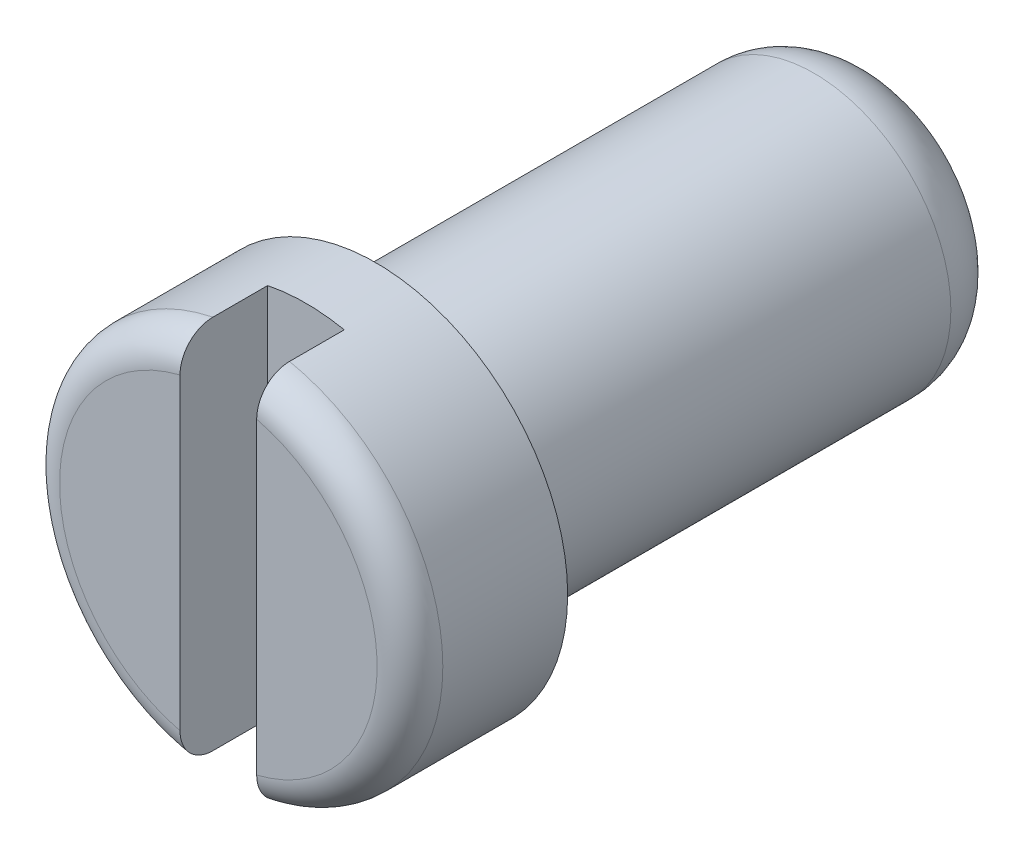
ISO-10303-21;
HEADER;
FILE_DESCRIPTION(('STEP AP214'),'2;1');
FILE_NAME('part.step','',(''),(''),'','','');
FILE_SCHEMA(('AUTOMOTIVE_DESIGN { 1 0 10303 214 1 1 1 1 }'));
ENDSEC;
DATA;
#1=APPLICATION_CONTEXT('core data for automotive mechanical design processes');
#2=APPLICATION_PROTOCOL_DEFINITION('international standard','automotive_design',2000,#1);
#3=PRODUCT_CONTEXT('',#1,'mechanical');
#4=PRODUCT('Part','Part','',(#3));
#5=PRODUCT_RELATED_PRODUCT_CATEGORY('part','',(#4));
#6=PRODUCT_DEFINITION_FORMATION('','',#4);
#7=PRODUCT_DEFINITION_CONTEXT('part definition',#1,'design');
#8=PRODUCT_DEFINITION('design','',#6,#7);
#9=PRODUCT_DEFINITION_SHAPE('','',#8);
#10=(LENGTH_UNIT() NAMED_UNIT(*) SI_UNIT(.MILLI.,.METRE.));
#11=(NAMED_UNIT(*) PLANE_ANGLE_UNIT() SI_UNIT($,.RADIAN.));
#12=(NAMED_UNIT(*) SI_UNIT($,.STERADIAN.) SOLID_ANGLE_UNIT());
#13=UNCERTAINTY_MEASURE_WITH_UNIT(LENGTH_MEASURE(1.E-05),#10,'distance_accuracy_value','');
#14=(GEOMETRIC_REPRESENTATION_CONTEXT(3) GLOBAL_UNCERTAINTY_ASSIGNED_CONTEXT((#13)) GLOBAL_UNIT_ASSIGNED_CONTEXT((#10,
#11,#12)) REPRESENTATION_CONTEXT('',''));
#15=CARTESIAN_POINT('',(0.,0.,0.));
#16=DIRECTION('',(0.,0.,1.));
#17=DIRECTION('',(1.,0.,0.));
#18=AXIS2_PLACEMENT_3D('',#15,#16,#17);
#19=CARTESIAN_POINT('',(0.,0.,0.639999999999999));
#20=DIRECTION('',(0.,0.,1.));
#21=DIRECTION('',(1.,0.,0.));
#22=AXIS2_PLACEMENT_3D('',#19,#20,#21);
#23=PLANE('',#22);
#24=CARTESIAN_POINT('',(0.,0.,0.64));
#25=DIRECTION('',(0.,0.,1.));
#26=DIRECTION('',(1.,0.,0.));
#27=AXIS2_PLACEMENT_3D('',#24,#25,#26);
#28=CIRCLE('',#27,1.75);
#29=CARTESIAN_POINT('',(0.35,1.71464281994822,0.64));
#30=VERTEX_POINT('',#29);
#31=CARTESIAN_POINT('',(-0.35,1.71464281994822,0.64));
#32=VERTEX_POINT('',#31);
#33=EDGE_CURVE('E79',#30,#32,#28,.T.);
#34=ORIENTED_EDGE('',*,*,#33,.T.);
#35=DIRECTION('',(0.,1.,0.));
#36=VECTOR('',#35,1.);
#37=CARTESIAN_POINT('',(-0.35,-2.5,0.64));
#38=LINE('',#37,#36);
#39=CARTESIAN_POINT('',(-0.35,-1.71464281994822,0.64));
#40=VERTEX_POINT('',#39);
#41=EDGE_CURVE('E82',#32,#40,#38,.F.);
#42=ORIENTED_EDGE('',*,*,#41,.T.);
#43=CARTESIAN_POINT('',(0.,0.,0.64));
#44=DIRECTION('',(0.,0.,1.));
#45=DIRECTION('',(1.,0.,0.));
#46=AXIS2_PLACEMENT_3D('',#43,#44,#45);
#47=CIRCLE('',#46,1.75);
#48=CARTESIAN_POINT('',(0.35,-1.71464281994822,0.64));
#49=VERTEX_POINT('',#48);
#50=EDGE_CURVE('E20',#40,#49,#47,.T.);
#51=ORIENTED_EDGE('',*,*,#50,.T.);
#52=DIRECTION('',(0.,1.,0.));
#53=VECTOR('',#52,1.);
#54=CARTESIAN_POINT('',(0.35,2.5,0.64));
#55=LINE('',#54,#53);
#56=EDGE_CURVE('E101',#49,#30,#55,.T.);
#57=ORIENTED_EDGE('',*,*,#56,.T.);
#58=EDGE_LOOP('',(#34,#42,#51,#57));
#59=FACE_BOUND('',#58,.T.);
#60=ADVANCED_FACE('F17',(#59),#23,.T.);
#61=CARTESIAN_POINT('',(0.35,2.5,1.44));
#62=DIRECTION('',(1.,0.,0.));
#63=DIRECTION('',(0.,0.,-1.));
#64=AXIS2_PLACEMENT_3D('',#61,#62,#63);
#65=PLANE('',#64);
#66=DIRECTION('',(0.,1.,0.));
#67=VECTOR('',#66,1.);
#68=CARTESIAN_POINT('',(0.35,0.,1.44));
#69=LINE('',#68,#67);
#70=CARTESIAN_POINT('',(0.35,1.40712472794703,1.44));
#71=VERTEX_POINT('',#70);
#72=CARTESIAN_POINT('',(0.35,-1.40712472794703,1.44));
#73=VERTEX_POINT('',#72);
#74=EDGE_CURVE('E112',#71,#73,#69,.F.);
#75=ORIENTED_EDGE('',*,*,#74,.F.);
#76=CARTESIAN_POINT('',(0.35,1.71464281994822,1.14));
#77=CARTESIAN_POINT('',(0.35,1.71465832877871,1.15661768421238));
#78=CARTESIAN_POINT('',(0.35,1.71323459979991,1.17322940138416));
#79=CARTESIAN_POINT('',(0.35,1.70762507526031,1.20595850036961));
#80=CARTESIAN_POINT('',(0.35,1.70344286069336,1.22207649477159));
#81=CARTESIAN_POINT('',(0.35,1.69243050159149,1.25338609632559));
#82=CARTESIAN_POINT('',(0.35,1.68559952821954,1.26857741178191));
#83=CARTESIAN_POINT('',(0.35,1.66950472990889,1.29760872831782));
#84=CARTESIAN_POINT('',(0.35,1.66024099174605,1.31144877757244));
#85=CARTESIAN_POINT('',(0.35,1.63947569207312,1.33751002731009));
#86=CARTESIAN_POINT('',(0.35,1.62795725429928,1.34971777202392));
#87=CARTESIAN_POINT('',(0.35,1.60306785319839,1.3720715972923));
#88=CARTESIAN_POINT('',(0.35,1.58969659668891,1.38221735093789));
#89=CARTESIAN_POINT('',(0.349999999999999,1.56120821534332,1.40037313395423));
#90=CARTESIAN_POINT('',(0.349999999999997,1.54606213966697,1.40833767773933));
#91=CARTESIAN_POINT('',(0.350000000000003,1.51467022412029,1.42167679982792));
#92=CARTESIAN_POINT('',(0.350000000000011,1.49842455767623,1.4270517854732));
#93=CARTESIAN_POINT('',(0.349999999999992,1.46962834851131,1.43404552472922));
#94=CARTESIAN_POINT('',(0.349999999999974,1.45722301038762,1.43627909035067));
#95=CARTESIAN_POINT('',(0.350000000000026,1.43225435406019,1.43925629166923));
#96=CARTESIAN_POINT('',(0.350000000000095,1.41969131286619,1.44000224901976));
#97=CARTESIAN_POINT('',(0.350000000000261,1.407124727947,1.44));
#98=B_SPLINE_CURVE_WITH_KNOTS('',3,(#76,#77,#78,#79,#80,#81,#82,#83,#84,#85,#86,#87,#88,#89,#90,
#91,#92,#93,#94,#95,#96,#97),.UNSPECIFIED.,.F.,.F.,(4,2,2,2,2,2,2,2,2,2,4),(0.,
0.0497832984911324,0.0995020964712911,0.149236464793092,0.198969059348318,0.249089208160175,
0.299217296854574,0.350322507802393,0.401419677189173,0.439148934538458,0.476819263051026),.UNSPECIFIED.);
#99=CARTESIAN_POINT('',(0.35,1.71464281994822,1.14));
#100=VERTEX_POINT('',#99);
#101=EDGE_CURVE('E100',#100,#71,#98,.T.);
#102=ORIENTED_EDGE('',*,*,#101,.F.);
#103=DIRECTION('',(0.,0.,-1.));
#104=VECTOR('',#103,1.);
#105=CARTESIAN_POINT('',(0.35,1.71464281994823,1.44));
#106=LINE('',#105,#104);
#107=EDGE_CURVE('E98',#30,#100,#106,.F.);
#108=ORIENTED_EDGE('',*,*,#107,.F.);
#109=ORIENTED_EDGE('',*,*,#56,.F.);
#110=DIRECTION('',(0.,0.,-1.));
#111=VECTOR('',#110,1.);
#112=CARTESIAN_POINT('',(0.35,-1.71464281994822,1.44));
#113=LINE('',#112,#111);
#114=CARTESIAN_POINT('',(0.34999999999999,-1.71464281994823,1.14));
#115=VERTEX_POINT('',#114);
#116=EDGE_CURVE('E75',#115,#49,#113,.T.);
#117=ORIENTED_EDGE('',*,*,#116,.F.);
#118=CARTESIAN_POINT('',(0.35,-1.40712472794703,1.44));
#119=CARTESIAN_POINT('',(0.35,-1.42478120218697,1.44001367978248));
#120=CARTESIAN_POINT('',(0.35,-1.44243897820919,1.43853272480425));
#121=CARTESIAN_POINT('',(0.35,-1.47726668334878,1.43265662263862));
#122=CARTESIAN_POINT('',(0.350000000000001,-1.49443650154852,1.42826081831599));
#123=CARTESIAN_POINT('',(0.35,-1.52780595373675,1.41662439496412));
#124=CARTESIAN_POINT('',(0.35,-1.54400460961193,1.40938096160932));
#125=CARTESIAN_POINT('',(0.35,-1.57491817942826,1.39223338334));
#126=CARTESIAN_POINT('',(0.350000000000001,-1.589633849193,1.3823306033253));
#127=CARTESIAN_POINT('',(0.350000000000001,-1.6168906366969,1.36031834232665));
#128=CARTESIAN_POINT('',(0.35,-1.62946500814752,1.34825005958696));
#129=CARTESIAN_POINT('',(0.35,-1.65234737733081,1.32212910754626));
#130=CARTESIAN_POINT('',(0.350000000000001,-1.66265587770605,1.30807687948591));
#131=CARTESIAN_POINT('',(0.350000000000002,-1.6804635449281,1.2787423772249));
#132=CARTESIAN_POINT('',(0.350000000000001,-1.68802251971158,1.26349634890726));
#133=CARTESIAN_POINT('',(0.349999999999999,-1.70041628677695,1.23194122011774));
#134=CARTESIAN_POINT('',(0.349999999999998,-1.70525354049939,1.21563309511696));
#135=CARTESIAN_POINT('',(0.35,-1.71064510869666,1.18932806185244));
#136=CARTESIAN_POINT('',(0.350000000000002,-1.71214354081741,1.1795151938897));
#137=CARTESIAN_POINT('',(0.349999999999998,-1.71414201655046,1.15980310407367));
#138=CARTESIAN_POINT('',(0.349999999999993,-1.7146435432004,1.14990403252965));
#139=CARTESIAN_POINT('',(0.349999999999981,-1.71464281994823,1.14000000000001));
#140=B_SPLINE_CURVE_WITH_KNOTS('',3,(#118,#119,#120,#121,#122,#123,#124,#125,#126,#127,#128,
#129,#130,#131,#132,#133,#134,#135,#136,#137,#138,#139),.UNSPECIFIED.,.F.,.F.,(4,2,2,2,2,2,2,2,
2,2,4),(0.,0.0529098267210858,0.105831585700994,0.158805779530312,0.211752836342823,
0.263782693896842,0.315800997891967,0.366608462474995,0.417369904195012,0.447103858333782,
0.476793545814193),.UNSPECIFIED.);
#141=EDGE_CURVE('E97',#73,#115,#140,.T.);
#142=ORIENTED_EDGE('',*,*,#141,.F.);
#143=EDGE_LOOP('',(#75,#102,#108,#109,#117,#142));
#144=FACE_BOUND('',#143,.T.);
#145=ADVANCED_FACE('F201',(#144),#65,.F.);
#146=CARTESIAN_POINT('',(-0.35,-2.5,1.44));
#147=DIRECTION('',(-1.,0.,0.));
#148=DIRECTION('',(0.,0.,1.));
#149=AXIS2_PLACEMENT_3D('',#146,#147,#148);
#150=PLANE('',#149);
#151=DIRECTION('',(0.,1.,0.));
#152=VECTOR('',#151,1.);
#153=CARTESIAN_POINT('',(-0.35,0.,1.44));
#154=LINE('',#153,#152);
#155=CARTESIAN_POINT('',(-0.35,-1.40712472794703,1.44));
#156=VERTEX_POINT('',#155);
#157=CARTESIAN_POINT('',(-0.35,1.40712472794703,1.44));
#158=VERTEX_POINT('',#157);
#159=EDGE_CURVE('E155',#156,#158,#154,.T.);
#160=ORIENTED_EDGE('',*,*,#159,.F.);
#161=CARTESIAN_POINT('',(-0.350000000000001,-1.71464281994822,1.14));
#162=CARTESIAN_POINT('',(-0.350000000000001,-1.71465832877871,1.15661768421238));
#163=CARTESIAN_POINT('',(-0.35,-1.71323459979991,1.17322940138416));
#164=CARTESIAN_POINT('',(-0.35,-1.70762507526031,1.20595850036961));
#165=CARTESIAN_POINT('',(-0.349999999999999,-1.70344286069336,1.22207649477159));
#166=CARTESIAN_POINT('',(-0.349999999999999,-1.69243050159149,1.25338609632559));
#167=CARTESIAN_POINT('',(-0.35,-1.68559952821954,1.26857741178191));
#168=CARTESIAN_POINT('',(-0.35,-1.66950472990889,1.29760872831782));
#169=CARTESIAN_POINT('',(-0.349999999999999,-1.66024099174605,1.31144877757244));
#170=CARTESIAN_POINT('',(-0.349999999999999,-1.63947569207312,1.33751002731009));
#171=CARTESIAN_POINT('',(-0.35,-1.62795725429928,1.34971777202391));
#172=CARTESIAN_POINT('',(-0.35,-1.60306785319839,1.3720715972923));
#173=CARTESIAN_POINT('',(-0.35,-1.58969659668891,1.38221735093789));
#174=CARTESIAN_POINT('',(-0.349999999999999,-1.56120821534332,1.40037313395423));
#175=CARTESIAN_POINT('',(-0.349999999999997,-1.54606213966697,1.40833767773933));
#176=CARTESIAN_POINT('',(-0.350000000000003,-1.51467022412029,1.42167679982792));
#177=CARTESIAN_POINT('',(-0.350000000000009,-1.49842455767623,1.4270517854732));
#178=CARTESIAN_POINT('',(-0.349999999999991,-1.46962834851131,1.43404552472922));
#179=CARTESIAN_POINT('',(-0.349999999999974,-1.45722301038762,1.43627909035067));
#180=CARTESIAN_POINT('',(-0.350000000000026,-1.43225435406019,1.43925629166923));
#181=CARTESIAN_POINT('',(-0.350000000000095,-1.41969131286619,1.44000224901976));
#182=CARTESIAN_POINT('',(-0.35000000000026,-1.407124727947,1.44));
#183=B_SPLINE_CURVE_WITH_KNOTS('',3,(#161,#162,#163,#164,#165,#166,#167,#168,#169,#170,#171,
#172,#173,#174,#175,#176,#177,#178,#179,#180,#181,#182),.UNSPECIFIED.,.F.,.F.,(4,2,2,2,2,2,2,2,
2,2,4),(0.,0.0497832984911324,0.0995020964712911,0.149236464793092,0.198969059348318,
0.249089208160175,0.299217296854574,0.350322507802393,0.401419677189173,0.439148934538457,
0.476819263051026),.UNSPECIFIED.);
#184=CARTESIAN_POINT('',(-0.35,-1.71464281994822,1.14));
#185=VERTEX_POINT('',#184);
#186=EDGE_CURVE('E87',#185,#156,#183,.T.);
#187=ORIENTED_EDGE('',*,*,#186,.F.);
#188=DIRECTION('',(0.,0.,1.));
#189=VECTOR('',#188,1.);
#190=CARTESIAN_POINT('',(-0.35,-1.71464281994823,1.44));
#191=LINE('',#190,#189);
#192=EDGE_CURVE('E71',#40,#185,#191,.T.);
#193=ORIENTED_EDGE('',*,*,#192,.F.);
#194=ORIENTED_EDGE('',*,*,#41,.F.);
#195=DIRECTION('',(0.,0.,1.));
#196=VECTOR('',#195,1.);
#197=CARTESIAN_POINT('',(-0.35,1.71464281994822,1.44));
#198=LINE('',#197,#196);
#199=CARTESIAN_POINT('',(-0.349999999999991,1.71464281994823,1.14));
#200=VERTEX_POINT('',#199);
#201=EDGE_CURVE('E83',#200,#32,#198,.F.);
#202=ORIENTED_EDGE('',*,*,#201,.F.);
#203=CARTESIAN_POINT('',(-0.35,1.40712472794703,1.44));
#204=CARTESIAN_POINT('',(-0.35,1.42478120218697,1.44001367978248));
#205=CARTESIAN_POINT('',(-0.35,1.44243897820919,1.43853272480425));
#206=CARTESIAN_POINT('',(-0.35,1.47726668334878,1.43265662263862));
#207=CARTESIAN_POINT('',(-0.350000000000001,1.49443650154852,1.42826081831599));
#208=CARTESIAN_POINT('',(-0.350000000000001,1.52780595373675,1.41662439496412));
#209=CARTESIAN_POINT('',(-0.35,1.54400460961193,1.40938096160932));
#210=CARTESIAN_POINT('',(-0.35,1.57491817942826,1.39223338334));
#211=CARTESIAN_POINT('',(-0.35,1.589633849193,1.3823306033253));
#212=CARTESIAN_POINT('',(-0.35,1.6168906366969,1.36031834232665));
#213=CARTESIAN_POINT('',(-0.35,1.62946500814753,1.34825005958696));
#214=CARTESIAN_POINT('',(-0.35,1.65234737733081,1.32212910754626));
#215=CARTESIAN_POINT('',(-0.35,1.66265587770606,1.30807687948591));
#216=CARTESIAN_POINT('',(-0.35,1.6804635449281,1.27874237722489));
#217=CARTESIAN_POINT('',(-0.350000000000001,1.68802251971158,1.26349634890726));
#218=CARTESIAN_POINT('',(-0.349999999999999,1.70041628677695,1.23194122011774));
#219=CARTESIAN_POINT('',(-0.349999999999998,1.70525354049939,1.21563309511696));
#220=CARTESIAN_POINT('',(-0.35,1.71064510869666,1.18932806185244));
#221=CARTESIAN_POINT('',(-0.350000000000001,1.71214354081741,1.1795151938897));
#222=CARTESIAN_POINT('',(-0.349999999999999,1.71414201655046,1.15980310407367));
#223=CARTESIAN_POINT('',(-0.349999999999994,1.7146435432004,1.14990403252965));
#224=CARTESIAN_POINT('',(-0.349999999999983,1.71464281994823,1.14000000000001));
#225=B_SPLINE_CURVE_WITH_KNOTS('',3,(#203,#204,#205,#206,#207,#208,#209,#210,#211,#212,#213,
#214,#215,#216,#217,#218,#219,#220,#221,#222,#223,#224),.UNSPECIFIED.,.F.,.F.,(4,2,2,2,2,2,2,2,
2,2,4),(0.,0.052909826721086,0.105831585700995,0.158805779530313,0.211752836342824,
0.263782693896843,0.315800997891969,0.366608462474996,0.417369904195013,0.447103858333782,
0.476793545814193),.UNSPECIFIED.);
#226=EDGE_CURVE('E35',#158,#200,#225,.T.);
#227=ORIENTED_EDGE('',*,*,#226,.F.);
#228=EDGE_LOOP('',(#160,#187,#193,#194,#202,#227));
#229=FACE_BOUND('',#228,.T.);
#230=ADVANCED_FACE('F86',(#229),#150,.F.);
#231=CARTESIAN_POINT('',(0.,0.,1.44));
#232=DIRECTION('',(0.,0.,1.));
#233=DIRECTION('',(1.,0.,0.));
#234=AXIS2_PLACEMENT_3D('',#231,#232,#233);
#235=PLANE('',#234);
#236=CARTESIAN_POINT('',(0.,0.,1.44));
#237=DIRECTION('',(0.,0.,-1.));
#238=DIRECTION('',(0.241379310344828,0.97043084686002,0.));
#239=AXIS2_PLACEMENT_3D('',#236,#237,#238);
#240=CIRCLE('',#239,1.45);
#241=EDGE_CURVE('E186',#71,#73,#240,.T.);
#242=ORIENTED_EDGE('',*,*,#241,.F.);
#243=ORIENTED_EDGE('',*,*,#74,.T.);
#244=EDGE_LOOP('',(#242,#243));
#245=FACE_BOUND('',#244,.T.);
#246=ADVANCED_FACE('F165',(#245),#235,.T.);
#247=CARTESIAN_POINT('',(0.,0.,1.44));
#248=DIRECTION('',(0.,0.,1.));
#249=DIRECTION('',(1.,0.,0.));
#250=AXIS2_PLACEMENT_3D('',#247,#248,#249);
#251=PLANE('',#250);
#252=CARTESIAN_POINT('',(0.,0.,1.44));
#253=DIRECTION('',(0.,0.,-1.));
#254=DIRECTION('',(-0.241379310344828,-0.97043084686002,0.));
#255=AXIS2_PLACEMENT_3D('',#252,#253,#254);
#256=CIRCLE('',#255,1.45);
#257=EDGE_CURVE('E147',#156,#158,#256,.T.);
#258=ORIENTED_EDGE('',*,*,#257,.F.);
#259=ORIENTED_EDGE('',*,*,#159,.T.);
#260=EDGE_LOOP('',(#258,#259));
#261=FACE_BOUND('',#260,.T.);
#262=ADVANCED_FACE('F157',(#261),#251,.T.);
#263=CARTESIAN_POINT('',(0.,0.,1.14));
#264=DIRECTION('',(0.,0.,1.));
#265=DIRECTION('',(1.,0.,0.));
#266=AXIS2_PLACEMENT_3D('',#263,#264,#265);
#267=TOROIDAL_SURFACE('',#266,1.45,0.3);
#268=ORIENTED_EDGE('',*,*,#141,.T.);
#269=CARTESIAN_POINT('',(0.,0.,1.14));
#270=DIRECTION('',(0.,0.,1.));
#271=DIRECTION('',(1.,0.,0.));
#272=AXIS2_PLACEMENT_3D('',#269,#270,#271);
#273=CIRCLE('',#272,1.75);
#274=EDGE_CURVE('E143',#100,#115,#273,.F.);
#275=ORIENTED_EDGE('',*,*,#274,.F.);
#276=ORIENTED_EDGE('',*,*,#101,.T.);
#277=ORIENTED_EDGE('',*,*,#241,.T.);
#278=EDGE_LOOP('',(#268,#275,#276,#277));
#279=FACE_BOUND('',#278,.T.);
#280=ADVANCED_FACE('F128',(#279),#267,.T.);
#281=CARTESIAN_POINT('',(0.,0.,1.14));
#282=DIRECTION('',(0.,0.,1.));
#283=DIRECTION('',(1.,0.,0.));
#284=AXIS2_PLACEMENT_3D('',#281,#282,#283);
#285=TOROIDAL_SURFACE('',#284,1.45,0.3);
#286=ORIENTED_EDGE('',*,*,#226,.T.);
#287=CARTESIAN_POINT('',(0.,0.,1.14));
#288=DIRECTION('',(0.,0.,1.));
#289=DIRECTION('',(1.,0.,0.));
#290=AXIS2_PLACEMENT_3D('',#287,#288,#289);
#291=CIRCLE('',#290,1.75);
#292=EDGE_CURVE('E110',#185,#200,#291,.F.);
#293=ORIENTED_EDGE('',*,*,#292,.F.);
#294=ORIENTED_EDGE('',*,*,#186,.T.);
#295=ORIENTED_EDGE('',*,*,#257,.T.);
#296=EDGE_LOOP('',(#286,#293,#294,#295));
#297=FACE_BOUND('',#296,.T.);
#298=ADVANCED_FACE('F123',(#297),#285,.T.);
#299=CARTESIAN_POINT('',(0.,0.,0.));
#300=DIRECTION('',(0.,0.,1.));
#301=DIRECTION('',(1.,0.,0.));
#302=AXIS2_PLACEMENT_3D('',#299,#300,#301);
#303=CYLINDRICAL_SURFACE('',#302,1.75);
#304=CARTESIAN_POINT('',(0.,0.,0.));
#305=DIRECTION('',(0.,0.,1.));
#306=DIRECTION('',(1.,0.,0.));
#307=AXIS2_PLACEMENT_3D('',#304,#305,#306);
#308=CIRCLE('',#307,1.75);
#309=CARTESIAN_POINT('',(1.75,0.,0.));
#310=VERTEX_POINT('',#309);
#311=EDGE_CURVE('E107',#310,#310,#308,.T.);
#312=ORIENTED_EDGE('',*,*,#311,.T.);
#313=EDGE_LOOP('',(#312));
#314=FACE_BOUND('',#313,.T.);
#315=ORIENTED_EDGE('',*,*,#33,.F.);
#316=ORIENTED_EDGE('',*,*,#107,.T.);
#317=ORIENTED_EDGE('',*,*,#274,.T.);
#318=ORIENTED_EDGE('',*,*,#116,.T.);
#319=ORIENTED_EDGE('',*,*,#50,.F.);
#320=ORIENTED_EDGE('',*,*,#192,.T.);
#321=ORIENTED_EDGE('',*,*,#292,.T.);
#322=ORIENTED_EDGE('',*,*,#201,.T.);
#323=EDGE_LOOP('',(#315,#316,#317,#318,#319,#320,#321,#322));
#324=FACE_BOUND('',#323,.T.);
#325=ADVANCED_FACE('F68',(#314,#324),#303,.T.);
#326=CARTESIAN_POINT('',(0.,0.,-4.6));
#327=DIRECTION('',(0.,0.,1.));
#328=DIRECTION('',(1.,0.,0.));
#329=AXIS2_PLACEMENT_3D('',#326,#327,#328);
#330=PLANE('',#329);
#331=CARTESIAN_POINT('',(0.,0.,-4.6));
#332=DIRECTION('',(0.,0.,1.));
#333=DIRECTION('',(1.,0.,0.));
#334=AXIS2_PLACEMENT_3D('',#331,#332,#333);
#335=CIRCLE('',#334,0.65);
#336=CARTESIAN_POINT('',(0.65,0.,-4.6));
#337=VERTEX_POINT('',#336);
#338=EDGE_CURVE('E106',#337,#337,#335,.T.);
#339=ORIENTED_EDGE('',*,*,#338,.F.);
#340=EDGE_LOOP('',(#339));
#341=FACE_BOUND('',#340,.T.);
#342=ADVANCED_FACE('F248',(#341),#330,.F.);
#343=CARTESIAN_POINT('',(0.,0.,0.));
#344=DIRECTION('',(0.,0.,1.));
#345=DIRECTION('',(1.,0.,0.));
#346=AXIS2_PLACEMENT_3D('',#343,#344,#345);
#347=PLANE('',#346);
#348=CARTESIAN_POINT('',(0.,0.,0.));
#349=DIRECTION('',(0.,0.,-1.));
#350=DIRECTION('',(-1.,0.,0.));
#351=AXIS2_PLACEMENT_3D('',#348,#349,#350);
#352=CIRCLE('',#351,1.25);
#353=CARTESIAN_POINT('',(-1.25,0.,0.));
#354=VERTEX_POINT('',#353);
#355=EDGE_CURVE('E26',#354,#354,#352,.T.);
#356=ORIENTED_EDGE('',*,*,#355,.F.);
#357=EDGE_LOOP('',(#356));
#358=FACE_BOUND('',#357,.T.);
#359=ORIENTED_EDGE('',*,*,#311,.F.);
#360=EDGE_LOOP('',(#359));
#361=FACE_BOUND('',#360,.T.);
#362=ADVANCED_FACE('F232',(#358,#361),#347,.F.);
#363=CARTESIAN_POINT('',(0.,0.,-4.));
#364=DIRECTION('',(0.,0.,-1.));
#365=DIRECTION('',(-1.,0.,0.));
#366=AXIS2_PLACEMENT_3D('',#363,#364,#365);
#367=TOROIDAL_SURFACE('',#366,0.65,0.6);
#368=ORIENTED_EDGE('',*,*,#338,.T.);
#369=EDGE_LOOP('',(#368));
#370=FACE_BOUND('',#369,.T.);
#371=CARTESIAN_POINT('',(0.,0.,-4.));
#372=DIRECTION('',(0.,0.,-1.));
#373=DIRECTION('',(-1.,0.,0.));
#374=AXIS2_PLACEMENT_3D('',#371,#372,#373);
#375=CIRCLE('',#374,1.25);
#376=CARTESIAN_POINT('',(-1.25,0.,-4.));
#377=VERTEX_POINT('',#376);
#378=EDGE_CURVE('E11',#377,#377,#375,.F.);
#379=ORIENTED_EDGE('',*,*,#378,.F.);
#380=EDGE_LOOP('',(#379));
#381=FACE_BOUND('',#380,.T.);
#382=ADVANCED_FACE('F226',(#370,#381),#367,.T.);
#383=CARTESIAN_POINT('',(0.,0.,0.));
#384=DIRECTION('',(0.,0.,-1.));
#385=DIRECTION('',(-1.,0.,0.));
#386=AXIS2_PLACEMENT_3D('',#383,#384,#385);
#387=CYLINDRICAL_SURFACE('',#386,1.25);
#388=ORIENTED_EDGE('',*,*,#378,.T.);
#389=EDGE_LOOP('',(#388));
#390=FACE_BOUND('',#389,.T.);
#391=ORIENTED_EDGE('',*,*,#355,.T.);
#392=EDGE_LOOP('',(#391));
#393=FACE_BOUND('',#392,.T.);
#394=ADVANCED_FACE('F224',(#390,#393),#387,.T.);
#395=CLOSED_SHELL('',(#60,#145,#230,#246,#262,#280,#298,#325,#342,#362,#382,#394));
#396=MANIFOLD_SOLID_BREP('B1',#395);
#397=ADVANCED_BREP_SHAPE_REPRESENTATION('',(#18,#396),#14);
#398=SHAPE_DEFINITION_REPRESENTATION(#9,#397);
ENDSEC;
END-ISO-10303-21;
